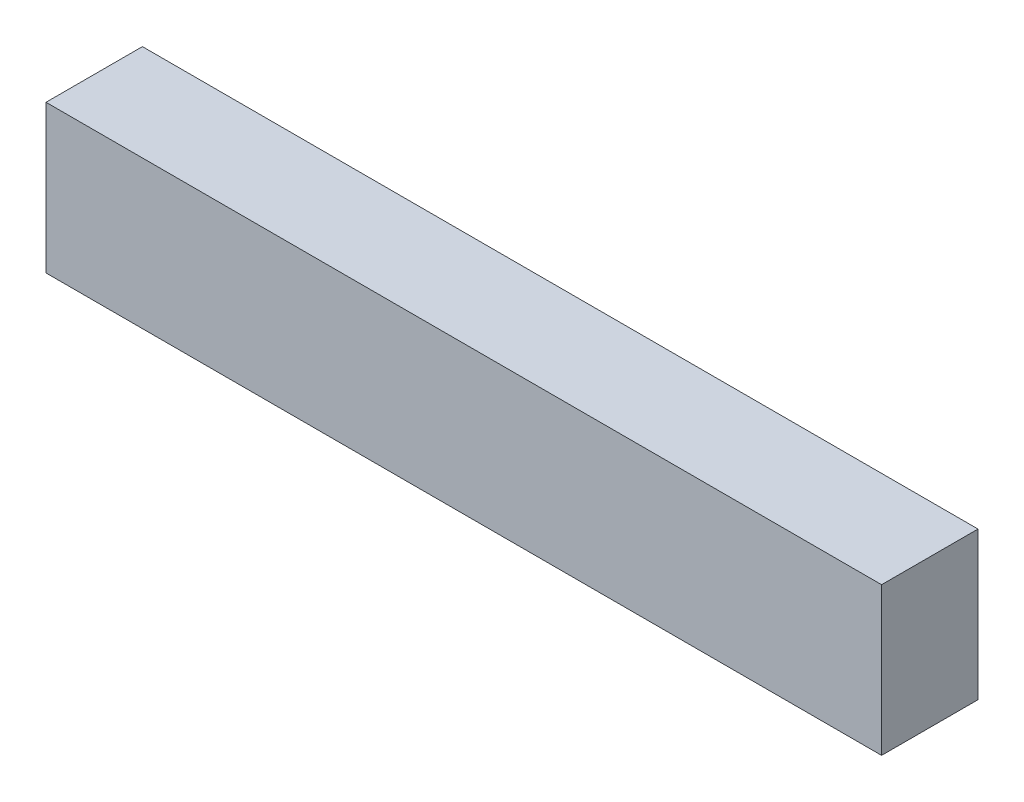
ISO-10303-21;
HEADER;
FILE_DESCRIPTION(('STEP AP214'),'2;1');
FILE_NAME('part.step','',(''),(''),'','','');
FILE_SCHEMA(('AUTOMOTIVE_DESIGN { 1 0 10303 214 1 1 1 1 }'));
ENDSEC;
DATA;
#1=APPLICATION_CONTEXT('core data for automotive mechanical design processes');
#2=APPLICATION_PROTOCOL_DEFINITION('international standard','automotive_design',2000,#1);
#3=PRODUCT_CONTEXT('',#1,'mechanical');
#4=PRODUCT('Part','Part','',(#3));
#5=PRODUCT_RELATED_PRODUCT_CATEGORY('part','',(#4));
#6=PRODUCT_DEFINITION_FORMATION('','',#4);
#7=PRODUCT_DEFINITION_CONTEXT('part definition',#1,'design');
#8=PRODUCT_DEFINITION('design','',#6,#7);
#9=PRODUCT_DEFINITION_SHAPE('','',#8);
#10=(LENGTH_UNIT() NAMED_UNIT(*) SI_UNIT(.MILLI.,.METRE.));
#11=(NAMED_UNIT(*) PLANE_ANGLE_UNIT() SI_UNIT($,.RADIAN.));
#12=(NAMED_UNIT(*) SI_UNIT($,.STERADIAN.) SOLID_ANGLE_UNIT());
#13=UNCERTAINTY_MEASURE_WITH_UNIT(LENGTH_MEASURE(1.E-05),#10,'distance_accuracy_value','');
#14=(GEOMETRIC_REPRESENTATION_CONTEXT(3) GLOBAL_UNCERTAINTY_ASSIGNED_CONTEXT((#13)) GLOBAL_UNIT_ASSIGNED_CONTEXT((#10,
#11,#12)) REPRESENTATION_CONTEXT('',''));
#15=CARTESIAN_POINT('',(0.,0.,0.));
#16=DIRECTION('',(0.,0.,1.));
#17=DIRECTION('',(1.,0.,0.));
#18=AXIS2_PLACEMENT_3D('',#15,#16,#17);
#19=CARTESIAN_POINT('',(65.,23.,7.5));
#20=DIRECTION('',(-1.,0.,0.));
#21=DIRECTION('',(0.,0.,1.));
#22=AXIS2_PLACEMENT_3D('',#19,#20,#21);
#23=PLANE('',#22);
#24=DIRECTION('',(0.,0.,-1.));
#25=VECTOR('',#24,1.);
#26=CARTESIAN_POINT('',(65.,0.,7.5));
#27=LINE('',#26,#25);
#28=CARTESIAN_POINT('',(65.,0.,7.5));
#29=VERTEX_POINT('',#28);
#30=CARTESIAN_POINT('',(65.,0.,-7.5));
#31=VERTEX_POINT('',#30);
#32=EDGE_CURVE('E96',#29,#31,#27,.T.);
#33=ORIENTED_EDGE('',*,*,#32,.T.);
#34=DIRECTION('',(0.,-1.,0.));
#35=VECTOR('',#34,1.);
#36=CARTESIAN_POINT('',(65.,23.,-7.5));
#37=LINE('',#36,#35);
#38=CARTESIAN_POINT('',(65.,23.,-7.5));
#39=VERTEX_POINT('',#38);
#40=EDGE_CURVE('E11',#39,#31,#37,.T.);
#41=ORIENTED_EDGE('',*,*,#40,.F.);
#42=DIRECTION('',(0.,0.,-1.));
#43=VECTOR('',#42,1.);
#44=CARTESIAN_POINT('',(65.,23.,7.5));
#45=LINE('',#44,#43);
#46=CARTESIAN_POINT('',(65.,23.,7.5));
#47=VERTEX_POINT('',#46);
#48=EDGE_CURVE('E84',#47,#39,#45,.T.);
#49=ORIENTED_EDGE('',*,*,#48,.F.);
#50=DIRECTION('',(0.,-1.,0.));
#51=VECTOR('',#50,1.);
#52=CARTESIAN_POINT('',(65.,23.,7.5));
#53=LINE('',#52,#51);
#54=EDGE_CURVE('E92',#47,#29,#53,.T.);
#55=ORIENTED_EDGE('',*,*,#54,.T.);
#56=EDGE_LOOP('',(#33,#41,#49,#55));
#57=FACE_BOUND('',#56,.T.);
#58=ADVANCED_FACE('F33',(#57),#23,.F.);
#59=CARTESIAN_POINT('',(-65.,23.,-7.5));
#60=DIRECTION('',(0.,0.,1.));
#61=DIRECTION('',(1.,0.,0.));
#62=AXIS2_PLACEMENT_3D('',#59,#60,#61);
#63=PLANE('',#62);
#64=DIRECTION('',(-1.,0.,0.));
#65=VECTOR('',#64,1.);
#66=CARTESIAN_POINT('',(-65.,0.,-7.5));
#67=LINE('',#66,#65);
#68=CARTESIAN_POINT('',(-65.,0.,-7.5));
#69=VERTEX_POINT('',#68);
#70=EDGE_CURVE('E88',#31,#69,#67,.T.);
#71=ORIENTED_EDGE('',*,*,#70,.T.);
#72=DIRECTION('',(0.,-1.,0.));
#73=VECTOR('',#72,1.);
#74=CARTESIAN_POINT('',(-65.,23.,-7.5));
#75=LINE('',#74,#73);
#76=CARTESIAN_POINT('',(-65.,23.,-7.5));
#77=VERTEX_POINT('',#76);
#78=EDGE_CURVE('E41',#77,#69,#75,.T.);
#79=ORIENTED_EDGE('',*,*,#78,.F.);
#80=DIRECTION('',(-1.,0.,0.));
#81=VECTOR('',#80,1.);
#82=CARTESIAN_POINT('',(-65.,23.,-7.5));
#83=LINE('',#82,#81);
#84=EDGE_CURVE('E79',#39,#77,#83,.T.);
#85=ORIENTED_EDGE('',*,*,#84,.F.);
#86=ORIENTED_EDGE('',*,*,#40,.T.);
#87=EDGE_LOOP('',(#71,#79,#85,#86));
#88=FACE_BOUND('',#87,.T.);
#89=ADVANCED_FACE('F87',(#88),#63,.F.);
#90=CARTESIAN_POINT('',(-65.,23.,7.5));
#91=DIRECTION('',(1.,0.,0.));
#92=DIRECTION('',(0.,0.,-1.));
#93=AXIS2_PLACEMENT_3D('',#90,#91,#92);
#94=PLANE('',#93);
#95=DIRECTION('',(0.,0.,1.));
#96=VECTOR('',#95,1.);
#97=CARTESIAN_POINT('',(-65.,0.,7.5));
#98=LINE('',#97,#96);
#99=CARTESIAN_POINT('',(-65.,0.,7.5));
#100=VERTEX_POINT('',#99);
#101=EDGE_CURVE('E66',#69,#100,#98,.T.);
#102=ORIENTED_EDGE('',*,*,#101,.T.);
#103=DIRECTION('',(0.,-1.,0.));
#104=VECTOR('',#103,1.);
#105=CARTESIAN_POINT('',(-65.,23.,7.5));
#106=LINE('',#105,#104);
#107=CARTESIAN_POINT('',(-65.,23.,7.5));
#108=VERTEX_POINT('',#107);
#109=EDGE_CURVE('E89',#108,#100,#106,.T.);
#110=ORIENTED_EDGE('',*,*,#109,.F.);
#111=DIRECTION('',(0.,0.,1.));
#112=VECTOR('',#111,1.);
#113=CARTESIAN_POINT('',(-65.,23.,7.5));
#114=LINE('',#113,#112);
#115=EDGE_CURVE('E82',#77,#108,#114,.T.);
#116=ORIENTED_EDGE('',*,*,#115,.F.);
#117=ORIENTED_EDGE('',*,*,#78,.T.);
#118=EDGE_LOOP('',(#102,#110,#116,#117));
#119=FACE_BOUND('',#118,.T.);
#120=ADVANCED_FACE('F90',(#119),#94,.F.);
#121=CARTESIAN_POINT('',(-65.,23.,7.5));
#122=DIRECTION('',(0.,0.,-1.));
#123=DIRECTION('',(-1.,0.,0.));
#124=AXIS2_PLACEMENT_3D('',#121,#122,#123);
#125=PLANE('',#124);
#126=DIRECTION('',(1.,0.,0.));
#127=VECTOR('',#126,1.);
#128=CARTESIAN_POINT('',(-65.,0.,7.5));
#129=LINE('',#128,#127);
#130=EDGE_CURVE('E72',#100,#29,#129,.T.);
#131=ORIENTED_EDGE('',*,*,#130,.T.);
#132=ORIENTED_EDGE('',*,*,#54,.F.);
#133=DIRECTION('',(1.,0.,0.));
#134=VECTOR('',#133,1.);
#135=CARTESIAN_POINT('',(-65.,23.,7.5));
#136=LINE('',#135,#134);
#137=EDGE_CURVE('E49',#108,#47,#136,.T.);
#138=ORIENTED_EDGE('',*,*,#137,.F.);
#139=ORIENTED_EDGE('',*,*,#109,.T.);
#140=EDGE_LOOP('',(#131,#132,#138,#139));
#141=FACE_BOUND('',#140,.T.);
#142=ADVANCED_FACE('F103',(#141),#125,.F.);
#143=CARTESIAN_POINT('',(0.,23.,0.));
#144=DIRECTION('',(0.,-1.,0.));
#145=DIRECTION('',(0.,0.,-1.));
#146=AXIS2_PLACEMENT_3D('',#143,#144,#145);
#147=PLANE('',#146);
#148=ORIENTED_EDGE('',*,*,#48,.T.);
#149=ORIENTED_EDGE('',*,*,#84,.T.);
#150=ORIENTED_EDGE('',*,*,#115,.T.);
#151=ORIENTED_EDGE('',*,*,#137,.T.);
#152=EDGE_LOOP('',(#148,#149,#150,#151));
#153=FACE_BOUND('',#152,.T.);
#154=ADVANCED_FACE('F80',(#153),#147,.F.);
#155=CARTESIAN_POINT('',(0.,0.,0.));
#156=DIRECTION('',(0.,-1.,0.));
#157=DIRECTION('',(0.,0.,-1.));
#158=AXIS2_PLACEMENT_3D('',#155,#156,#157);
#159=PLANE('',#158);
#160=ORIENTED_EDGE('',*,*,#32,.F.);
#161=ORIENTED_EDGE('',*,*,#130,.F.);
#162=ORIENTED_EDGE('',*,*,#101,.F.);
#163=ORIENTED_EDGE('',*,*,#70,.F.);
#164=EDGE_LOOP('',(#160,#161,#162,#163));
#165=FACE_BOUND('',#164,.T.);
#166=ADVANCED_FACE('F106',(#165),#159,.T.);
#167=CLOSED_SHELL('',(#58,#89,#120,#142,#154,#166));
#168=MANIFOLD_SOLID_BREP('B2',#167);
#169=ADVANCED_BREP_SHAPE_REPRESENTATION('',(#18,#168),#14);
#170=SHAPE_DEFINITION_REPRESENTATION(#9,#169);
ENDSEC;
END-ISO-10303-21;
